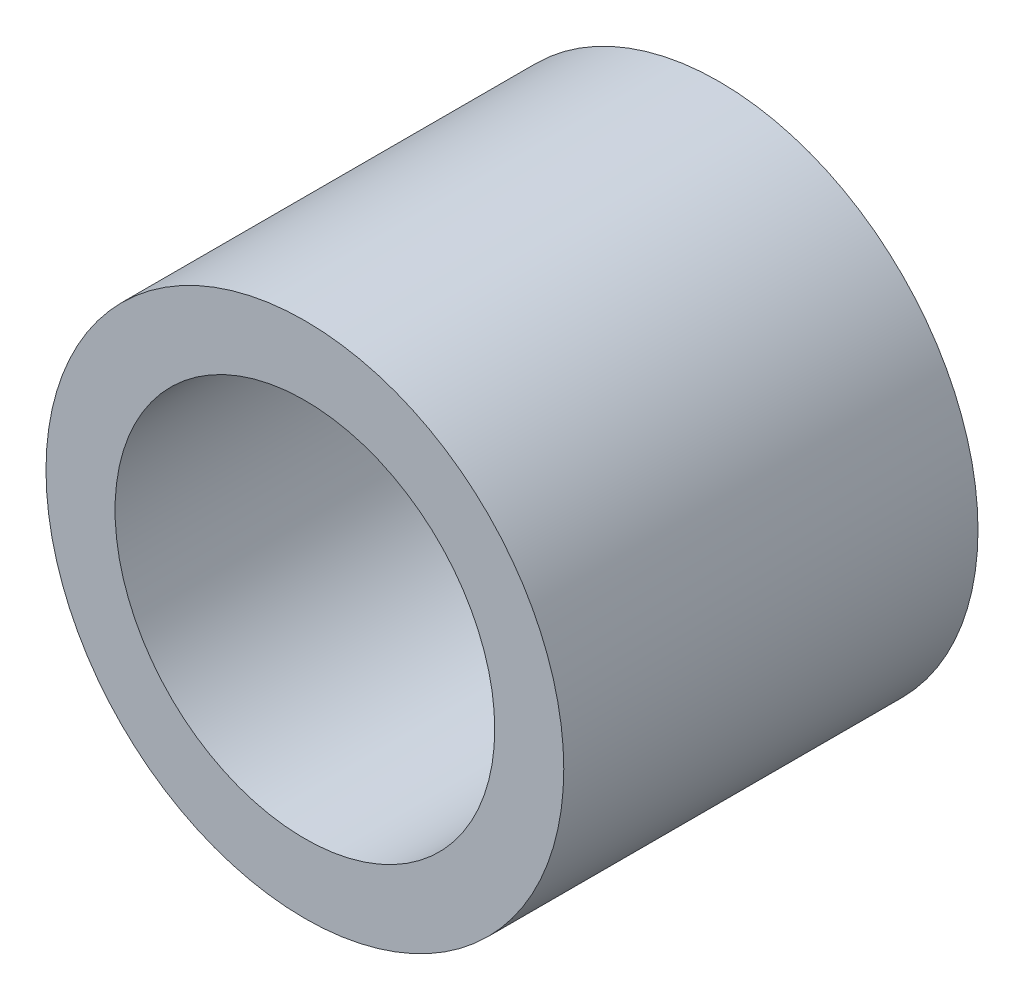
ISO-10303-21;
HEADER;
FILE_DESCRIPTION(('STEP AP214'),'2;1');
FILE_NAME('part.step','',(''),(''),'','','');
FILE_SCHEMA(('AUTOMOTIVE_DESIGN { 1 0 10303 214 1 1 1 1 }'));
ENDSEC;
DATA;
#1=APPLICATION_CONTEXT('core data for automotive mechanical design processes');
#2=APPLICATION_PROTOCOL_DEFINITION('international standard','automotive_design',2000,#1);
#3=PRODUCT_CONTEXT('',#1,'mechanical');
#4=PRODUCT('Part','Part','',(#3));
#5=PRODUCT_RELATED_PRODUCT_CATEGORY('part','',(#4));
#6=PRODUCT_DEFINITION_FORMATION('','',#4);
#7=PRODUCT_DEFINITION_CONTEXT('part definition',#1,'design');
#8=PRODUCT_DEFINITION('design','',#6,#7);
#9=PRODUCT_DEFINITION_SHAPE('','',#8);
#10=(LENGTH_UNIT() NAMED_UNIT(*) SI_UNIT(.MILLI.,.METRE.));
#11=(NAMED_UNIT(*) PLANE_ANGLE_UNIT() SI_UNIT($,.RADIAN.));
#12=(NAMED_UNIT(*) SI_UNIT($,.STERADIAN.) SOLID_ANGLE_UNIT());
#13=UNCERTAINTY_MEASURE_WITH_UNIT(LENGTH_MEASURE(1.E-05),#10,'distance_accuracy_value','');
#14=(GEOMETRIC_REPRESENTATION_CONTEXT(3) GLOBAL_UNCERTAINTY_ASSIGNED_CONTEXT((#13)) GLOBAL_UNIT_ASSIGNED_CONTEXT((#10,
#11,#12)) REPRESENTATION_CONTEXT('',''));
#15=CARTESIAN_POINT('',(0.,0.,0.));
#16=DIRECTION('',(0.,0.,1.));
#17=DIRECTION('',(1.,0.,0.));
#18=AXIS2_PLACEMENT_3D('',#15,#16,#17);
#19=CARTESIAN_POINT('',(0.,0.,6.));
#20=DIRECTION('',(0.,0.,1.));
#21=DIRECTION('',(1.,0.,0.));
#22=AXIS2_PLACEMENT_3D('',#19,#20,#21);
#23=PLANE('',#22);
#24=CARTESIAN_POINT('',(0.,0.,6.));
#25=DIRECTION('',(0.,0.,1.));
#26=DIRECTION('',(1.,0.,0.));
#27=AXIS2_PLACEMENT_3D('',#24,#25,#26);
#28=CIRCLE('',#27,3.75);
#29=CARTESIAN_POINT('',(3.75,0.,6.));
#30=VERTEX_POINT('',#29);
#31=EDGE_CURVE('E10',#30,#30,#28,.T.);
#32=ORIENTED_EDGE('',*,*,#31,.T.);
#33=EDGE_LOOP('',(#32));
#34=FACE_BOUND('',#33,.T.);
#35=CARTESIAN_POINT('',(0.,0.,6.));
#36=DIRECTION('',(0.,0.,1.));
#37=DIRECTION('',(1.,0.,0.));
#38=AXIS2_PLACEMENT_3D('',#35,#36,#37);
#39=CIRCLE('',#38,2.75);
#40=CARTESIAN_POINT('',(2.75,0.,6.));
#41=VERTEX_POINT('',#40);
#42=EDGE_CURVE('E56',#41,#41,#39,.T.);
#43=ORIENTED_EDGE('',*,*,#42,.F.);
#44=EDGE_LOOP('',(#43));
#45=FACE_BOUND('',#44,.T.);
#46=ADVANCED_FACE('F43',(#34,#45),#23,.T.);
#47=CARTESIAN_POINT('',(0.,0.,0.));
#48=DIRECTION('',(0.,0.,1.));
#49=DIRECTION('',(1.,0.,0.));
#50=AXIS2_PLACEMENT_3D('',#47,#48,#49);
#51=PLANE('',#50);
#52=CARTESIAN_POINT('',(0.,0.,0.));
#53=DIRECTION('',(0.,0.,1.));
#54=DIRECTION('',(1.,0.,0.));
#55=AXIS2_PLACEMENT_3D('',#52,#53,#54);
#56=CIRCLE('',#55,3.75);
#57=CARTESIAN_POINT('',(3.75,0.,0.));
#58=VERTEX_POINT('',#57);
#59=EDGE_CURVE('E47',#58,#58,#56,.T.);
#60=ORIENTED_EDGE('',*,*,#59,.F.);
#61=EDGE_LOOP('',(#60));
#62=FACE_BOUND('',#61,.T.);
#63=CARTESIAN_POINT('',(0.,0.,0.));
#64=DIRECTION('',(0.,0.,1.));
#65=DIRECTION('',(1.,0.,0.));
#66=AXIS2_PLACEMENT_3D('',#63,#64,#65);
#67=CIRCLE('',#66,2.75);
#68=CARTESIAN_POINT('',(2.75,0.,0.));
#69=VERTEX_POINT('',#68);
#70=EDGE_CURVE('E58',#69,#69,#67,.T.);
#71=ORIENTED_EDGE('',*,*,#70,.T.);
#72=EDGE_LOOP('',(#71));
#73=FACE_BOUND('',#72,.T.);
#74=ADVANCED_FACE('F70',(#62,#73),#51,.F.);
#75=CARTESIAN_POINT('',(0.,0.,6.));
#76=DIRECTION('',(0.,0.,-1.));
#77=DIRECTION('',(-1.,0.,0.));
#78=AXIS2_PLACEMENT_3D('',#75,#76,#77);
#79=CYLINDRICAL_SURFACE('',#78,3.75);
#80=ORIENTED_EDGE('',*,*,#31,.F.);
#81=EDGE_LOOP('',(#80));
#82=FACE_BOUND('',#81,.T.);
#83=ORIENTED_EDGE('',*,*,#59,.T.);
#84=EDGE_LOOP('',(#83));
#85=FACE_BOUND('',#84,.T.);
#86=ADVANCED_FACE('F45',(#82,#85),#79,.T.);
#87=CARTESIAN_POINT('',(0.,0.,6.));
#88=DIRECTION('',(0.,0.,-1.));
#89=DIRECTION('',(-1.,0.,0.));
#90=AXIS2_PLACEMENT_3D('',#87,#88,#89);
#91=CYLINDRICAL_SURFACE('',#90,2.75);
#92=ORIENTED_EDGE('',*,*,#42,.T.);
#93=EDGE_LOOP('',(#92));
#94=FACE_BOUND('',#93,.T.);
#95=ORIENTED_EDGE('',*,*,#70,.F.);
#96=EDGE_LOOP('',(#95));
#97=FACE_BOUND('',#96,.T.);
#98=ADVANCED_FACE('F66',(#94,#97),#91,.F.);
#99=CLOSED_SHELL('',(#46,#74,#86,#98));
#100=MANIFOLD_SOLID_BREP('B2',#99);
#101=ADVANCED_BREP_SHAPE_REPRESENTATION('',(#18,#100),#14);
#102=SHAPE_DEFINITION_REPRESENTATION(#9,#101);
ENDSEC;
END-ISO-10303-21;
